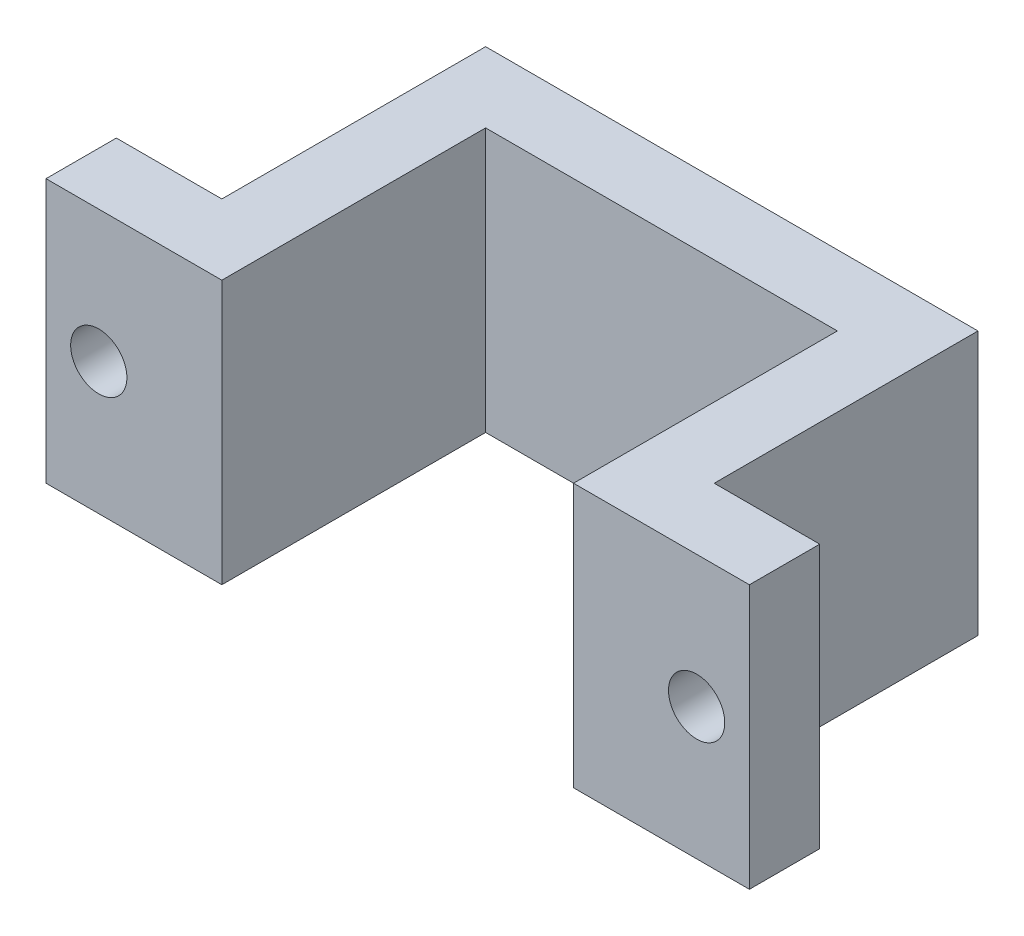
ISO-10303-21;
HEADER;
FILE_DESCRIPTION(('STEP AP214'),'2;1');
FILE_NAME('part.step','',(''),(''),'','','');
FILE_SCHEMA(('AUTOMOTIVE_DESIGN { 1 0 10303 214 1 1 1 1 }'));
ENDSEC;
DATA;
#1=APPLICATION_CONTEXT('core data for automotive mechanical design processes');
#2=APPLICATION_PROTOCOL_DEFINITION('international standard','automotive_design',2000,#1);
#3=PRODUCT_CONTEXT('',#1,'mechanical');
#4=PRODUCT('Part','Part','',(#3));
#5=PRODUCT_RELATED_PRODUCT_CATEGORY('part','',(#4));
#6=PRODUCT_DEFINITION_FORMATION('','',#4);
#7=PRODUCT_DEFINITION_CONTEXT('part definition',#1,'design');
#8=PRODUCT_DEFINITION('design','',#6,#7);
#9=PRODUCT_DEFINITION_SHAPE('','',#8);
#10=(LENGTH_UNIT() NAMED_UNIT(*) SI_UNIT(.MILLI.,.METRE.));
#11=(NAMED_UNIT(*) PLANE_ANGLE_UNIT() SI_UNIT($,.RADIAN.));
#12=(NAMED_UNIT(*) SI_UNIT($,.STERADIAN.) SOLID_ANGLE_UNIT());
#13=UNCERTAINTY_MEASURE_WITH_UNIT(LENGTH_MEASURE(1.E-05),#10,'distance_accuracy_value','');
#14=(GEOMETRIC_REPRESENTATION_CONTEXT(3) GLOBAL_UNCERTAINTY_ASSIGNED_CONTEXT((#13)) GLOBAL_UNIT_ASSIGNED_CONTEXT((#10,
#11,#12)) REPRESENTATION_CONTEXT('',''));
#15=CARTESIAN_POINT('',(0.,0.,0.));
#16=DIRECTION('',(0.,0.,1.));
#17=DIRECTION('',(1.,0.,0.));
#18=AXIS2_PLACEMENT_3D('',#15,#16,#17);
#19=CARTESIAN_POINT('',(0.,9.525,0.));
#20=DIRECTION('',(1.,0.,0.));
#21=DIRECTION('',(0.,0.,-1.));
#22=AXIS2_PLACEMENT_3D('',#19,#20,#21);
#23=PLANE('',#22);
#24=DIRECTION('',(0.,0.,1.));
#25=VECTOR('',#24,1.);
#26=CARTESIAN_POINT('',(0.,0.,0.));
#27=LINE('',#26,#25);
#28=CARTESIAN_POINT('',(0.,0.,-2.54));
#29=VERTEX_POINT('',#28);
#30=CARTESIAN_POINT('',(0.,0.,0.));
#31=VERTEX_POINT('',#30);
#32=EDGE_CURVE('E153',#29,#31,#27,.T.);
#33=ORIENTED_EDGE('',*,*,#32,.T.);
#34=DIRECTION('',(0.,-1.,0.));
#35=VECTOR('',#34,1.);
#36=CARTESIAN_POINT('',(0.,9.525,0.));
#37=LINE('',#36,#35);
#38=CARTESIAN_POINT('',(0.,9.525,0.));
#39=VERTEX_POINT('',#38);
#40=EDGE_CURVE('E11',#39,#31,#37,.T.);
#41=ORIENTED_EDGE('',*,*,#40,.F.);
#42=DIRECTION('',(0.,0.,1.));
#43=VECTOR('',#42,1.);
#44=CARTESIAN_POINT('',(0.,9.525,0.));
#45=LINE('',#44,#43);
#46=CARTESIAN_POINT('',(0.,9.525,-2.54));
#47=VERTEX_POINT('',#46);
#48=EDGE_CURVE('E176',#47,#39,#45,.T.);
#49=ORIENTED_EDGE('',*,*,#48,.F.);
#50=DIRECTION('',(0.,-1.,0.));
#51=VECTOR('',#50,1.);
#52=CARTESIAN_POINT('',(0.,9.525,-2.54));
#53=LINE('',#52,#51);
#54=EDGE_CURVE('E149',#47,#29,#53,.T.);
#55=ORIENTED_EDGE('',*,*,#54,.T.);
#56=EDGE_LOOP('',(#33,#41,#49,#55));
#57=FACE_BOUND('',#56,.T.);
#58=ADVANCED_FACE('F33',(#57),#23,.F.);
#59=CARTESIAN_POINT('',(0.,9.525,0.));
#60=DIRECTION('',(0.,0.,-1.));
#61=DIRECTION('',(-1.,0.,0.));
#62=AXIS2_PLACEMENT_3D('',#59,#60,#61);
#63=PLANE('',#62);
#64=CARTESIAN_POINT('',(1.905,4.7625,0.));
#65=DIRECTION('',(0.,0.,-1.));
#66=DIRECTION('',(-1.,0.,0.));
#67=AXIS2_PLACEMENT_3D('',#64,#65,#66);
#68=CIRCLE('',#67,1.016);
#69=CARTESIAN_POINT('',(0.889,4.7625,0.));
#70=VERTEX_POINT('',#69);
#71=EDGE_CURVE('E157',#70,#70,#68,.F.);
#72=ORIENTED_EDGE('',*,*,#71,.F.);
#73=EDGE_LOOP('',(#72));
#74=FACE_BOUND('',#73,.T.);
#75=DIRECTION('',(1.,0.,0.));
#76=VECTOR('',#75,1.);
#77=CARTESIAN_POINT('',(0.,0.,0.));
#78=LINE('',#77,#76);
#79=CARTESIAN_POINT('',(6.35,0.,0.));
#80=VERTEX_POINT('',#79);
#81=EDGE_CURVE('E156',#31,#80,#78,.T.);
#82=ORIENTED_EDGE('',*,*,#81,.T.);
#83=DIRECTION('',(0.,-1.,0.));
#84=VECTOR('',#83,1.);
#85=CARTESIAN_POINT('',(6.35,9.525,0.));
#86=LINE('',#85,#84);
#87=CARTESIAN_POINT('',(6.35,9.525,0.));
#88=VERTEX_POINT('',#87);
#89=EDGE_CURVE('E41',#88,#80,#86,.T.);
#90=ORIENTED_EDGE('',*,*,#89,.F.);
#91=DIRECTION('',(1.,0.,0.));
#92=VECTOR('',#91,1.);
#93=CARTESIAN_POINT('',(0.,9.525,0.));
#94=LINE('',#93,#92);
#95=EDGE_CURVE('E104',#39,#88,#94,.T.);
#96=ORIENTED_EDGE('',*,*,#95,.F.);
#97=ORIENTED_EDGE('',*,*,#40,.T.);
#98=EDGE_LOOP('',(#82,#90,#96,#97));
#99=FACE_BOUND('',#98,.T.);
#100=ADVANCED_FACE('F256',(#74,#99),#63,.F.);
#101=CARTESIAN_POINT('',(6.35,9.525,0.));
#102=DIRECTION('',(-1.,0.,0.));
#103=DIRECTION('',(0.,0.,1.));
#104=AXIS2_PLACEMENT_3D('',#101,#102,#103);
#105=PLANE('',#104);
#106=DIRECTION('',(0.,0.,-1.));
#107=VECTOR('',#106,1.);
#108=CARTESIAN_POINT('',(6.35,0.,0.));
#109=LINE('',#108,#107);
#110=CARTESIAN_POINT('',(6.35,0.,-9.525));
#111=VERTEX_POINT('',#110);
#112=EDGE_CURVE('E159',#80,#111,#109,.T.);
#113=ORIENTED_EDGE('',*,*,#112,.T.);
#114=DIRECTION('',(0.,-1.,0.));
#115=VECTOR('',#114,1.);
#116=CARTESIAN_POINT('',(6.35,9.525,-9.525));
#117=LINE('',#116,#115);
#118=CARTESIAN_POINT('',(6.35,9.525,-9.525));
#119=VERTEX_POINT('',#118);
#120=EDGE_CURVE('E195',#119,#111,#117,.T.);
#121=ORIENTED_EDGE('',*,*,#120,.F.);
#122=DIRECTION('',(0.,0.,-1.));
#123=VECTOR('',#122,1.);
#124=CARTESIAN_POINT('',(6.35,9.525,0.));
#125=LINE('',#124,#123);
#126=EDGE_CURVE('E203',#88,#119,#125,.T.);
#127=ORIENTED_EDGE('',*,*,#126,.F.);
#128=ORIENTED_EDGE('',*,*,#89,.T.);
#129=EDGE_LOOP('',(#113,#121,#127,#128));
#130=FACE_BOUND('',#129,.T.);
#131=ADVANCED_FACE('F201',(#130),#105,.F.);
#132=CARTESIAN_POINT('',(6.35,9.525,-9.525));
#133=DIRECTION('',(0.,0.,-1.));
#134=DIRECTION('',(-1.,0.,0.));
#135=AXIS2_PLACEMENT_3D('',#132,#133,#134);
#136=PLANE('',#135);
#137=DIRECTION('',(1.,0.,0.));
#138=VECTOR('',#137,1.);
#139=CARTESIAN_POINT('',(6.35,0.,-9.525));
#140=LINE('',#139,#138);
#141=CARTESIAN_POINT('',(19.05,0.,-9.525));
#142=VERTEX_POINT('',#141);
#143=EDGE_CURVE('E161',#111,#142,#140,.T.);
#144=ORIENTED_EDGE('',*,*,#143,.T.);
#145=DIRECTION('',(0.,-1.,0.));
#146=VECTOR('',#145,1.);
#147=CARTESIAN_POINT('',(19.05,9.525,-9.525));
#148=LINE('',#147,#146);
#149=CARTESIAN_POINT('',(19.05,9.525,-9.525));
#150=VERTEX_POINT('',#149);
#151=EDGE_CURVE('E192',#150,#142,#148,.T.);
#152=ORIENTED_EDGE('',*,*,#151,.F.);
#153=DIRECTION('',(1.,0.,0.));
#154=VECTOR('',#153,1.);
#155=CARTESIAN_POINT('',(6.35,9.525,-9.525));
#156=LINE('',#155,#154);
#157=EDGE_CURVE('E221',#119,#150,#156,.T.);
#158=ORIENTED_EDGE('',*,*,#157,.F.);
#159=ORIENTED_EDGE('',*,*,#120,.T.);
#160=EDGE_LOOP('',(#144,#152,#158,#159));
#161=FACE_BOUND('',#160,.T.);
#162=ADVANCED_FACE('F212',(#161),#136,.F.);
#163=CARTESIAN_POINT('',(19.05,9.525,-9.525));
#164=DIRECTION('',(1.,0.,0.));
#165=DIRECTION('',(0.,0.,-1.));
#166=AXIS2_PLACEMENT_3D('',#163,#164,#165);
#167=PLANE('',#166);
#168=DIRECTION('',(0.,0.,1.));
#169=VECTOR('',#168,1.);
#170=CARTESIAN_POINT('',(19.05,0.,-9.525));
#171=LINE('',#170,#169);
#172=CARTESIAN_POINT('',(19.05,0.,0.));
#173=VERTEX_POINT('',#172);
#174=EDGE_CURVE('E163',#142,#173,#171,.T.);
#175=ORIENTED_EDGE('',*,*,#174,.T.);
#176=DIRECTION('',(0.,-1.,0.));
#177=VECTOR('',#176,1.);
#178=CARTESIAN_POINT('',(19.05,9.525,0.));
#179=LINE('',#178,#177);
#180=CARTESIAN_POINT('',(19.05,9.525,0.));
#181=VERTEX_POINT('',#180);
#182=EDGE_CURVE('E189',#181,#173,#179,.T.);
#183=ORIENTED_EDGE('',*,*,#182,.F.);
#184=DIRECTION('',(0.,0.,1.));
#185=VECTOR('',#184,1.);
#186=CARTESIAN_POINT('',(19.05,9.525,-9.525));
#187=LINE('',#186,#185);
#188=EDGE_CURVE('E218',#150,#181,#187,.T.);
#189=ORIENTED_EDGE('',*,*,#188,.F.);
#190=ORIENTED_EDGE('',*,*,#151,.T.);
#191=EDGE_LOOP('',(#175,#183,#189,#190));
#192=FACE_BOUND('',#191,.T.);
#193=ADVANCED_FACE('F216',(#192),#167,.F.);
#194=CARTESIAN_POINT('',(19.05,9.525,0.));
#195=DIRECTION('',(0.,0.,-1.));
#196=DIRECTION('',(-1.,0.,0.));
#197=AXIS2_PLACEMENT_3D('',#194,#195,#196);
#198=PLANE('',#197);
#199=CARTESIAN_POINT('',(23.495,4.7625,0.));
#200=DIRECTION('',(0.,0.,-1.));
#201=DIRECTION('',(-1.,0.,0.));
#202=AXIS2_PLACEMENT_3D('',#199,#200,#201);
#203=CIRCLE('',#202,1.016);
#204=CARTESIAN_POINT('',(22.479,4.7625,0.));
#205=VERTEX_POINT('',#204);
#206=EDGE_CURVE('E361',#205,#205,#203,.F.);
#207=ORIENTED_EDGE('',*,*,#206,.F.);
#208=EDGE_LOOP('',(#207));
#209=FACE_BOUND('',#208,.T.);
#210=DIRECTION('',(1.,0.,0.));
#211=VECTOR('',#210,1.);
#212=CARTESIAN_POINT('',(19.05,0.,0.));
#213=LINE('',#212,#211);
#214=CARTESIAN_POINT('',(25.4,0.,0.));
#215=VERTEX_POINT('',#214);
#216=EDGE_CURVE('E165',#173,#215,#213,.T.);
#217=ORIENTED_EDGE('',*,*,#216,.T.);
#218=DIRECTION('',(0.,-1.,0.));
#219=VECTOR('',#218,1.);
#220=CARTESIAN_POINT('',(25.4,9.525,0.));
#221=LINE('',#220,#219);
#222=CARTESIAN_POINT('',(25.4,9.525,0.));
#223=VERTEX_POINT('',#222);
#224=EDGE_CURVE('E186',#223,#215,#221,.T.);
#225=ORIENTED_EDGE('',*,*,#224,.F.);
#226=DIRECTION('',(1.,0.,0.));
#227=VECTOR('',#226,1.);
#228=CARTESIAN_POINT('',(19.05,9.525,0.));
#229=LINE('',#228,#227);
#230=EDGE_CURVE('E220',#181,#223,#229,.T.);
#231=ORIENTED_EDGE('',*,*,#230,.F.);
#232=ORIENTED_EDGE('',*,*,#182,.T.);
#233=EDGE_LOOP('',(#217,#225,#231,#232));
#234=FACE_BOUND('',#233,.T.);
#235=ADVANCED_FACE('F271',(#209,#234),#198,.F.);
#236=CARTESIAN_POINT('',(25.4,9.525,0.));
#237=DIRECTION('',(-1.,0.,0.));
#238=DIRECTION('',(0.,0.,1.));
#239=AXIS2_PLACEMENT_3D('',#236,#237,#238);
#240=PLANE('',#239);
#241=DIRECTION('',(0.,0.,-1.));
#242=VECTOR('',#241,1.);
#243=CARTESIAN_POINT('',(25.4,0.,0.));
#244=LINE('',#243,#242);
#245=CARTESIAN_POINT('',(25.4,0.,-2.54));
#246=VERTEX_POINT('',#245);
#247=EDGE_CURVE('E167',#215,#246,#244,.T.);
#248=ORIENTED_EDGE('',*,*,#247,.T.);
#249=DIRECTION('',(0.,-1.,0.));
#250=VECTOR('',#249,1.);
#251=CARTESIAN_POINT('',(25.4,9.525,-2.54));
#252=LINE('',#251,#250);
#253=CARTESIAN_POINT('',(25.4,9.525,-2.54));
#254=VERTEX_POINT('',#253);
#255=EDGE_CURVE('E183',#254,#246,#252,.T.);
#256=ORIENTED_EDGE('',*,*,#255,.F.);
#257=DIRECTION('',(0.,0.,-1.));
#258=VECTOR('',#257,1.);
#259=CARTESIAN_POINT('',(25.4,9.525,0.));
#260=LINE('',#259,#258);
#261=EDGE_CURVE('E223',#223,#254,#260,.T.);
#262=ORIENTED_EDGE('',*,*,#261,.F.);
#263=ORIENTED_EDGE('',*,*,#224,.T.);
#264=EDGE_LOOP('',(#248,#256,#262,#263));
#265=FACE_BOUND('',#264,.T.);
#266=ADVANCED_FACE('F274',(#265),#240,.F.);
#267=CARTESIAN_POINT('',(21.59,9.525,-2.54));
#268=DIRECTION('',(0.,0.,1.));
#269=DIRECTION('',(1.,0.,0.));
#270=AXIS2_PLACEMENT_3D('',#267,#268,#269);
#271=PLANE('',#270);
#272=CARTESIAN_POINT('',(23.495,4.7625,-2.54));
#273=DIRECTION('',(0.,0.,-1.));
#274=DIRECTION('',(-1.,0.,0.));
#275=AXIS2_PLACEMENT_3D('',#272,#273,#274);
#276=CIRCLE('',#275,1.016);
#277=CARTESIAN_POINT('',(22.479,4.7625,-2.54));
#278=VERTEX_POINT('',#277);
#279=EDGE_CURVE('E358',#278,#278,#276,.T.);
#280=ORIENTED_EDGE('',*,*,#279,.F.);
#281=EDGE_LOOP('',(#280));
#282=FACE_BOUND('',#281,.T.);
#283=DIRECTION('',(-1.,0.,0.));
#284=VECTOR('',#283,1.);
#285=CARTESIAN_POINT('',(21.59,0.,-2.54));
#286=LINE('',#285,#284);
#287=CARTESIAN_POINT('',(21.59,0.,-2.54));
#288=VERTEX_POINT('',#287);
#289=EDGE_CURVE('E169',#246,#288,#286,.T.);
#290=ORIENTED_EDGE('',*,*,#289,.T.);
#291=DIRECTION('',(0.,-1.,0.));
#292=VECTOR('',#291,1.);
#293=CARTESIAN_POINT('',(21.59,9.525,-2.54));
#294=LINE('',#293,#292);
#295=CARTESIAN_POINT('',(21.59,9.525,-2.54));
#296=VERTEX_POINT('',#295);
#297=EDGE_CURVE('E180',#296,#288,#294,.T.);
#298=ORIENTED_EDGE('',*,*,#297,.F.);
#299=DIRECTION('',(-1.,0.,0.));
#300=VECTOR('',#299,1.);
#301=CARTESIAN_POINT('',(21.59,9.525,-2.54));
#302=LINE('',#301,#300);
#303=EDGE_CURVE('E229',#254,#296,#302,.T.);
#304=ORIENTED_EDGE('',*,*,#303,.F.);
#305=ORIENTED_EDGE('',*,*,#255,.T.);
#306=EDGE_LOOP('',(#290,#298,#304,#305));
#307=FACE_BOUND('',#306,.T.);
#308=ADVANCED_FACE('F235',(#282,#307),#271,.F.);
#309=CARTESIAN_POINT('',(21.59,9.525,-12.065));
#310=DIRECTION('',(-1.,0.,0.));
#311=DIRECTION('',(0.,0.,1.));
#312=AXIS2_PLACEMENT_3D('',#309,#310,#311);
#313=PLANE('',#312);
#314=DIRECTION('',(0.,0.,-1.));
#315=VECTOR('',#314,1.);
#316=CARTESIAN_POINT('',(21.59,0.,-12.065));
#317=LINE('',#316,#315);
#318=CARTESIAN_POINT('',(21.59,0.,-12.065));
#319=VERTEX_POINT('',#318);
#320=EDGE_CURVE('E171',#288,#319,#317,.T.);
#321=ORIENTED_EDGE('',*,*,#320,.T.);
#322=DIRECTION('',(0.,-1.,0.));
#323=VECTOR('',#322,1.);
#324=CARTESIAN_POINT('',(21.59,9.525,-12.065));
#325=LINE('',#324,#323);
#326=CARTESIAN_POINT('',(21.59,9.525,-12.065));
#327=VERTEX_POINT('',#326);
#328=EDGE_CURVE('E144',#327,#319,#325,.T.);
#329=ORIENTED_EDGE('',*,*,#328,.F.);
#330=DIRECTION('',(0.,0.,-1.));
#331=VECTOR('',#330,1.);
#332=CARTESIAN_POINT('',(21.59,9.525,-12.065));
#333=LINE('',#332,#331);
#334=EDGE_CURVE('E135',#296,#327,#333,.T.);
#335=ORIENTED_EDGE('',*,*,#334,.F.);
#336=ORIENTED_EDGE('',*,*,#297,.T.);
#337=EDGE_LOOP('',(#321,#329,#335,#336));
#338=FACE_BOUND('',#337,.T.);
#339=ADVANCED_FACE('F239',(#338),#313,.F.);
#340=CARTESIAN_POINT('',(3.81,9.525,-12.065));
#341=DIRECTION('',(0.,0.,1.));
#342=DIRECTION('',(1.,0.,0.));
#343=AXIS2_PLACEMENT_3D('',#340,#341,#342);
#344=PLANE('',#343);
#345=DIRECTION('',(-1.,0.,0.));
#346=VECTOR('',#345,1.);
#347=CARTESIAN_POINT('',(3.81,0.,-12.065));
#348=LINE('',#347,#346);
#349=CARTESIAN_POINT('',(3.81,0.,-12.065));
#350=VERTEX_POINT('',#349);
#351=EDGE_CURVE('E143',#319,#350,#348,.T.);
#352=ORIENTED_EDGE('',*,*,#351,.T.);
#353=DIRECTION('',(0.,-1.,0.));
#354=VECTOR('',#353,1.);
#355=CARTESIAN_POINT('',(3.81,9.525,-12.065));
#356=LINE('',#355,#354);
#357=CARTESIAN_POINT('',(3.81,9.525,-12.065));
#358=VERTEX_POINT('',#357);
#359=EDGE_CURVE('E140',#358,#350,#356,.T.);
#360=ORIENTED_EDGE('',*,*,#359,.F.);
#361=DIRECTION('',(-1.,0.,0.));
#362=VECTOR('',#361,1.);
#363=CARTESIAN_POINT('',(3.81,9.525,-12.065));
#364=LINE('',#363,#362);
#365=EDGE_CURVE('E129',#327,#358,#364,.T.);
#366=ORIENTED_EDGE('',*,*,#365,.F.);
#367=ORIENTED_EDGE('',*,*,#328,.T.);
#368=EDGE_LOOP('',(#352,#360,#366,#367));
#369=FACE_BOUND('',#368,.T.);
#370=ADVANCED_FACE('F141',(#369),#344,.F.);
#371=CARTESIAN_POINT('',(3.81,9.525,-2.54));
#372=DIRECTION('',(1.,0.,0.));
#373=DIRECTION('',(0.,0.,-1.));
#374=AXIS2_PLACEMENT_3D('',#371,#372,#373);
#375=PLANE('',#374);
#376=DIRECTION('',(0.,0.,1.));
#377=VECTOR('',#376,1.);
#378=CARTESIAN_POINT('',(3.81,0.,-2.54));
#379=LINE('',#378,#377);
#380=CARTESIAN_POINT('',(3.81,0.,-2.54));
#381=VERTEX_POINT('',#380);
#382=EDGE_CURVE('E90',#350,#381,#379,.T.);
#383=ORIENTED_EDGE('',*,*,#382,.T.);
#384=DIRECTION('',(0.,-1.,0.));
#385=VECTOR('',#384,1.);
#386=CARTESIAN_POINT('',(3.81,9.525,-2.54));
#387=LINE('',#386,#385);
#388=CARTESIAN_POINT('',(3.81,9.525,-2.54));
#389=VERTEX_POINT('',#388);
#390=EDGE_CURVE('E145',#389,#381,#387,.T.);
#391=ORIENTED_EDGE('',*,*,#390,.F.);
#392=DIRECTION('',(0.,0.,1.));
#393=VECTOR('',#392,1.);
#394=CARTESIAN_POINT('',(3.81,9.525,-2.54));
#395=LINE('',#394,#393);
#396=EDGE_CURVE('E133',#358,#389,#395,.T.);
#397=ORIENTED_EDGE('',*,*,#396,.F.);
#398=ORIENTED_EDGE('',*,*,#359,.T.);
#399=EDGE_LOOP('',(#383,#391,#397,#398));
#400=FACE_BOUND('',#399,.T.);
#401=ADVANCED_FACE('F147',(#400),#375,.F.);
#402=CARTESIAN_POINT('',(0.,9.525,-2.54));
#403=DIRECTION('',(0.,0.,1.));
#404=DIRECTION('',(1.,0.,0.));
#405=AXIS2_PLACEMENT_3D('',#402,#403,#404);
#406=PLANE('',#405);
#407=CARTESIAN_POINT('',(1.905,4.7625,-2.54));
#408=DIRECTION('',(0.,0.,-1.));
#409=DIRECTION('',(-1.,0.,0.));
#410=AXIS2_PLACEMENT_3D('',#407,#408,#409);
#411=CIRCLE('',#410,1.016);
#412=CARTESIAN_POINT('',(0.889,4.7625,-2.54));
#413=VERTEX_POINT('',#412);
#414=EDGE_CURVE('E362',#413,#413,#411,.T.);
#415=ORIENTED_EDGE('',*,*,#414,.F.);
#416=EDGE_LOOP('',(#415));
#417=FACE_BOUND('',#416,.T.);
#418=DIRECTION('',(-1.,0.,0.));
#419=VECTOR('',#418,1.);
#420=CARTESIAN_POINT('',(0.,0.,-2.54));
#421=LINE('',#420,#419);
#422=EDGE_CURVE('E96',#381,#29,#421,.T.);
#423=ORIENTED_EDGE('',*,*,#422,.T.);
#424=ORIENTED_EDGE('',*,*,#54,.F.);
#425=DIRECTION('',(-1.,0.,0.));
#426=VECTOR('',#425,1.);
#427=CARTESIAN_POINT('',(0.,9.525,-2.54));
#428=LINE('',#427,#426);
#429=EDGE_CURVE('E49',#389,#47,#428,.T.);
#430=ORIENTED_EDGE('',*,*,#429,.F.);
#431=ORIENTED_EDGE('',*,*,#390,.T.);
#432=EDGE_LOOP('',(#423,#424,#430,#431));
#433=FACE_BOUND('',#432,.T.);
#434=ADVANCED_FACE('F243',(#417,#433),#406,.F.);
#435=CARTESIAN_POINT('',(0.,9.525,0.));
#436=DIRECTION('',(0.,-1.,0.));
#437=DIRECTION('',(0.,0.,-1.));
#438=AXIS2_PLACEMENT_3D('',#435,#436,#437);
#439=PLANE('',#438);
#440=ORIENTED_EDGE('',*,*,#48,.T.);
#441=ORIENTED_EDGE('',*,*,#95,.T.);
#442=ORIENTED_EDGE('',*,*,#126,.T.);
#443=ORIENTED_EDGE('',*,*,#157,.T.);
#444=ORIENTED_EDGE('',*,*,#188,.T.);
#445=ORIENTED_EDGE('',*,*,#230,.T.);
#446=ORIENTED_EDGE('',*,*,#261,.T.);
#447=ORIENTED_EDGE('',*,*,#303,.T.);
#448=ORIENTED_EDGE('',*,*,#334,.T.);
#449=ORIENTED_EDGE('',*,*,#365,.T.);
#450=ORIENTED_EDGE('',*,*,#396,.T.);
#451=ORIENTED_EDGE('',*,*,#429,.T.);
#452=EDGE_LOOP('',(#440,#441,#442,#443,#444,#445,#446,#447,#448,#449,#450,#451));
#453=FACE_BOUND('',#452,.T.);
#454=ADVANCED_FACE('F131',(#453),#439,.F.);
#455=CARTESIAN_POINT('',(0.,0.,0.));
#456=DIRECTION('',(0.,-1.,0.));
#457=DIRECTION('',(0.,0.,-1.));
#458=AXIS2_PLACEMENT_3D('',#455,#456,#457);
#459=PLANE('',#458);
#460=ORIENTED_EDGE('',*,*,#32,.F.);
#461=ORIENTED_EDGE('',*,*,#422,.F.);
#462=ORIENTED_EDGE('',*,*,#382,.F.);
#463=ORIENTED_EDGE('',*,*,#351,.F.);
#464=ORIENTED_EDGE('',*,*,#320,.F.);
#465=ORIENTED_EDGE('',*,*,#289,.F.);
#466=ORIENTED_EDGE('',*,*,#247,.F.);
#467=ORIENTED_EDGE('',*,*,#216,.F.);
#468=ORIENTED_EDGE('',*,*,#174,.F.);
#469=ORIENTED_EDGE('',*,*,#143,.F.);
#470=ORIENTED_EDGE('',*,*,#112,.F.);
#471=ORIENTED_EDGE('',*,*,#81,.F.);
#472=EDGE_LOOP('',(#460,#461,#462,#463,#464,#465,#466,#467,#468,#469,#470,#471));
#473=FACE_BOUND('',#472,.T.);
#474=ADVANCED_FACE('F207',(#473),#459,.T.);
#475=CARTESIAN_POINT('',(1.905,4.7625,0.00100000000000013));
#476=DIRECTION('',(0.,0.,-1.));
#477=DIRECTION('',(-1.,0.,0.));
#478=AXIS2_PLACEMENT_3D('',#475,#476,#477);
#479=CYLINDRICAL_SURFACE('',#478,1.016);
#480=ORIENTED_EDGE('',*,*,#414,.T.);
#481=EDGE_LOOP('',(#480));
#482=FACE_BOUND('',#481,.T.);
#483=ORIENTED_EDGE('',*,*,#71,.T.);
#484=EDGE_LOOP('',(#483));
#485=FACE_BOUND('',#484,.T.);
#486=ADVANCED_FACE('F308',(#482,#485),#479,.F.);
#487=CARTESIAN_POINT('',(23.495,4.7625,0.00100000000000013));
#488=DIRECTION('',(0.,0.,-1.));
#489=DIRECTION('',(-1.,0.,0.));
#490=AXIS2_PLACEMENT_3D('',#487,#488,#489);
#491=CYLINDRICAL_SURFACE('',#490,1.016);
#492=ORIENTED_EDGE('',*,*,#279,.T.);
#493=EDGE_LOOP('',(#492));
#494=FACE_BOUND('',#493,.T.);
#495=ORIENTED_EDGE('',*,*,#206,.T.);
#496=EDGE_LOOP('',(#495));
#497=FACE_BOUND('',#496,.T.);
#498=ADVANCED_FACE('F341',(#494,#497),#491,.F.);
#499=CLOSED_SHELL('',(#58,#100,#131,#162,#193,#235,#266,#308,#339,#370,#401,#434,#454,#474,#486,#498));
#500=MANIFOLD_SOLID_BREP('B2',#499);
#501=ADVANCED_BREP_SHAPE_REPRESENTATION('',(#18,#500),#14);
#502=SHAPE_DEFINITION_REPRESENTATION(#9,#501);
ENDSEC;
END-ISO-10303-21;
